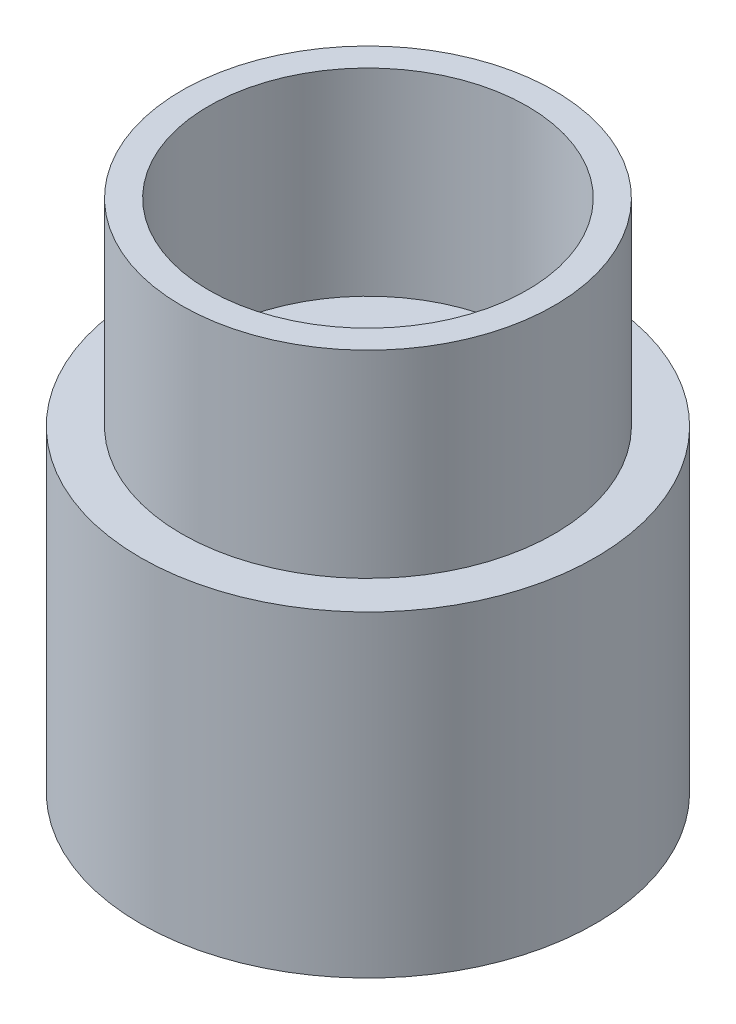
ISO-10303-21;
HEADER;
FILE_DESCRIPTION(('STEP AP214'),'2;1');
FILE_NAME('part.step','',(''),(''),'','','');
FILE_SCHEMA(('AUTOMOTIVE_DESIGN { 1 0 10303 214 1 1 1 1 }'));
ENDSEC;
DATA;
#1=APPLICATION_CONTEXT('core data for automotive mechanical design processes');
#2=APPLICATION_PROTOCOL_DEFINITION('international standard','automotive_design',2000,#1);
#3=PRODUCT_CONTEXT('',#1,'mechanical');
#4=PRODUCT('Part','Part','',(#3));
#5=PRODUCT_RELATED_PRODUCT_CATEGORY('part','',(#4));
#6=PRODUCT_DEFINITION_FORMATION('','',#4);
#7=PRODUCT_DEFINITION_CONTEXT('part definition',#1,'design');
#8=PRODUCT_DEFINITION('design','',#6,#7);
#9=PRODUCT_DEFINITION_SHAPE('','',#8);
#10=(LENGTH_UNIT() NAMED_UNIT(*) SI_UNIT(.MILLI.,.METRE.));
#11=(NAMED_UNIT(*) PLANE_ANGLE_UNIT() SI_UNIT($,.RADIAN.));
#12=(NAMED_UNIT(*) SI_UNIT($,.STERADIAN.) SOLID_ANGLE_UNIT());
#13=UNCERTAINTY_MEASURE_WITH_UNIT(LENGTH_MEASURE(1.E-05),#10,'distance_accuracy_value','');
#14=(GEOMETRIC_REPRESENTATION_CONTEXT(3) GLOBAL_UNCERTAINTY_ASSIGNED_CONTEXT((#13)) GLOBAL_UNIT_ASSIGNED_CONTEXT((#10,
#11,#12)) REPRESENTATION_CONTEXT('',''));
#15=CARTESIAN_POINT('',(0.,0.,0.));
#16=DIRECTION('',(0.,0.,1.));
#17=DIRECTION('',(1.,0.,0.));
#18=AXIS2_PLACEMENT_3D('',#15,#16,#17);
#19=CARTESIAN_POINT('',(0.,6.,0.));
#20=DIRECTION('',(0.,1.,0.));
#21=DIRECTION('',(0.,0.,1.));
#22=AXIS2_PLACEMENT_3D('',#19,#20,#21);
#23=PLANE('',#22);
#24=CARTESIAN_POINT('',(0.,6.,0.));
#25=DIRECTION('',(0.,1.,0.));
#26=DIRECTION('',(0.,0.,1.));
#27=AXIS2_PLACEMENT_3D('',#24,#25,#26);
#28=CIRCLE('',#27,11.05);
#29=CARTESIAN_POINT('',(0.,6.,11.05));
#30=VERTEX_POINT('',#29);
#31=EDGE_CURVE('E43',#30,#30,#28,.T.);
#32=ORIENTED_EDGE('',*,*,#31,.T.);
#33=EDGE_LOOP('',(#32));
#34=FACE_BOUND('',#33,.T.);
#35=CARTESIAN_POINT('',(0.,6.,0.));
#36=DIRECTION('',(0.,1.,0.));
#37=DIRECTION('',(0.,0.,1.));
#38=AXIS2_PLACEMENT_3D('',#35,#36,#37);
#39=CIRCLE('',#38,9.05);
#40=CARTESIAN_POINT('',(0.,6.,9.05));
#41=VERTEX_POINT('',#40);
#42=EDGE_CURVE('E50',#41,#41,#39,.T.);
#43=ORIENTED_EDGE('',*,*,#42,.F.);
#44=EDGE_LOOP('',(#43));
#45=FACE_BOUND('',#44,.T.);
#46=ADVANCED_FACE('F32',(#34,#45),#23,.T.);
#47=CARTESIAN_POINT('',(0.,-9.4,0.));
#48=DIRECTION('',(0.,1.,0.));
#49=DIRECTION('',(0.,0.,1.));
#50=AXIS2_PLACEMENT_3D('',#47,#48,#49);
#51=CYLINDRICAL_SURFACE('',#50,11.05);
#52=CARTESIAN_POINT('',(0.,-9.4,0.));
#53=DIRECTION('',(0.,1.,0.));
#54=DIRECTION('',(0.,0.,1.));
#55=AXIS2_PLACEMENT_3D('',#52,#53,#54);
#56=CIRCLE('',#55,11.05);
#57=CARTESIAN_POINT('',(0.,-9.4,11.05));
#58=VERTEX_POINT('',#57);
#59=EDGE_CURVE('E39',#58,#58,#56,.T.);
#60=ORIENTED_EDGE('',*,*,#59,.T.);
#61=EDGE_LOOP('',(#60));
#62=FACE_BOUND('',#61,.T.);
#63=ORIENTED_EDGE('',*,*,#31,.F.);
#64=EDGE_LOOP('',(#63));
#65=FACE_BOUND('',#64,.T.);
#66=ADVANCED_FACE('F34',(#62,#65),#51,.T.);
#67=CARTESIAN_POINT('',(0.,-9.4,0.));
#68=DIRECTION('',(0.,1.,0.));
#69=DIRECTION('',(0.,0.,1.));
#70=AXIS2_PLACEMENT_3D('',#67,#68,#69);
#71=PLANE('',#70);
#72=CARTESIAN_POINT('',(0.,-9.4,0.));
#73=DIRECTION('',(0.,-1.,0.));
#74=DIRECTION('',(0.,0.,-1.));
#75=AXIS2_PLACEMENT_3D('',#72,#73,#74);
#76=CIRCLE('',#75,9.15);
#77=CARTESIAN_POINT('',(0.,-9.4,-9.15));
#78=VERTEX_POINT('',#77);
#79=EDGE_CURVE('E58',#78,#78,#76,.T.);
#80=ORIENTED_EDGE('',*,*,#79,.F.);
#81=EDGE_LOOP('',(#80));
#82=FACE_BOUND('',#81,.T.);
#83=ORIENTED_EDGE('',*,*,#59,.F.);
#84=EDGE_LOOP('',(#83));
#85=FACE_BOUND('',#84,.T.);
#86=ADVANCED_FACE('F116',(#82,#85),#71,.F.);
#87=CARTESIAN_POINT('',(0.,15.6,0.));
#88=DIRECTION('',(0.,1.,0.));
#89=DIRECTION('',(0.,0.,1.));
#90=AXIS2_PLACEMENT_3D('',#87,#88,#89);
#91=PLANE('',#90);
#92=CARTESIAN_POINT('',(0.,15.6,0.));
#93=DIRECTION('',(0.,1.,0.));
#94=DIRECTION('',(0.,0.,1.));
#95=AXIS2_PLACEMENT_3D('',#92,#93,#94);
#96=CIRCLE('',#95,9.05);
#97=CARTESIAN_POINT('',(0.,15.6,9.05));
#98=VERTEX_POINT('',#97);
#99=EDGE_CURVE('E47',#98,#98,#96,.T.);
#100=ORIENTED_EDGE('',*,*,#99,.T.);
#101=EDGE_LOOP('',(#100));
#102=FACE_BOUND('',#101,.T.);
#103=CARTESIAN_POINT('',(0.,15.6,0.));
#104=DIRECTION('',(0.,1.,0.));
#105=DIRECTION('',(0.,0.,1.));
#106=AXIS2_PLACEMENT_3D('',#103,#104,#105);
#107=CIRCLE('',#106,7.74);
#108=CARTESIAN_POINT('',(0.,15.6,7.74));
#109=VERTEX_POINT('',#108);
#110=EDGE_CURVE('E53',#109,#109,#107,.T.);
#111=ORIENTED_EDGE('',*,*,#110,.F.);
#112=EDGE_LOOP('',(#111));
#113=FACE_BOUND('',#112,.T.);
#114=ADVANCED_FACE('F122',(#102,#113),#91,.T.);
#115=CARTESIAN_POINT('',(0.,15.6,0.));
#116=DIRECTION('',(0.,-1.,0.));
#117=DIRECTION('',(0.,0.,-1.));
#118=AXIS2_PLACEMENT_3D('',#115,#116,#117);
#119=CYLINDRICAL_SURFACE('',#118,9.05);
#120=ORIENTED_EDGE('',*,*,#99,.F.);
#121=EDGE_LOOP('',(#120));
#122=FACE_BOUND('',#121,.T.);
#123=ORIENTED_EDGE('',*,*,#42,.T.);
#124=EDGE_LOOP('',(#123));
#125=FACE_BOUND('',#124,.T.);
#126=ADVANCED_FACE('F107',(#122,#125),#119,.T.);
#127=CARTESIAN_POINT('',(0.,15.6,0.));
#128=DIRECTION('',(0.,-1.,0.));
#129=DIRECTION('',(0.,0.,-1.));
#130=AXIS2_PLACEMENT_3D('',#127,#128,#129);
#131=CYLINDRICAL_SURFACE('',#130,7.74);
#132=ORIENTED_EDGE('',*,*,#110,.T.);
#133=EDGE_LOOP('',(#132));
#134=FACE_BOUND('',#133,.T.);
#135=CARTESIAN_POINT('',(0.,6.,0.));
#136=DIRECTION('',(0.,1.,0.));
#137=DIRECTION('',(0.,0.,1.));
#138=AXIS2_PLACEMENT_3D('',#135,#136,#137);
#139=CIRCLE('',#138,7.74);
#140=CARTESIAN_POINT('',(0.,6.,7.74));
#141=VERTEX_POINT('',#140);
#142=EDGE_CURVE('E10',#141,#141,#139,.F.);
#143=ORIENTED_EDGE('',*,*,#142,.T.);
#144=EDGE_LOOP('',(#143));
#145=FACE_BOUND('',#144,.T.);
#146=ADVANCED_FACE('F97',(#134,#145),#131,.F.);
#147=CARTESIAN_POINT('',(0.,6.,0.));
#148=DIRECTION('',(0.,1.,0.));
#149=DIRECTION('',(0.,0.,1.));
#150=AXIS2_PLACEMENT_3D('',#147,#148,#149);
#151=CIRCLE('',#150,3.05);
#152=CARTESIAN_POINT('',(0.,6.,3.05));
#153=VERTEX_POINT('',#152);
#154=EDGE_CURVE('E61',#153,#153,#151,.T.);
#155=ORIENTED_EDGE('',*,*,#154,.F.);
#156=EDGE_LOOP('',(#155));
#157=FACE_BOUND('',#156,.T.);
#158=ORIENTED_EDGE('',*,*,#142,.F.);
#159=EDGE_LOOP('',(#158));
#160=FACE_BOUND('',#159,.T.);
#161=ADVANCED_FACE('F94',(#157,#160),#23,.T.);
#162=CARTESIAN_POINT('',(0.,25.8801081914276,0.));
#163=DIRECTION('',(0.,-1.,0.));
#164=DIRECTION('',(0.,0.,-1.));
#165=AXIS2_PLACEMENT_3D('',#162,#163,#164);
#166=CYLINDRICAL_SURFACE('',#165,9.15);
#167=ORIENTED_EDGE('',*,*,#79,.T.);
#168=EDGE_LOOP('',(#167));
#169=FACE_BOUND('',#168,.T.);
#170=CARTESIAN_POINT('',(0.,0.,0.));
#171=DIRECTION('',(0.,1.,0.));
#172=DIRECTION('',(0.,0.,1.));
#173=AXIS2_PLACEMENT_3D('',#170,#171,#172);
#174=CIRCLE('',#173,9.15);
#175=CARTESIAN_POINT('',(0.,0.,9.15));
#176=VERTEX_POINT('',#175);
#177=EDGE_CURVE('E70',#176,#176,#174,.T.);
#178=ORIENTED_EDGE('',*,*,#177,.T.);
#179=EDGE_LOOP('',(#178));
#180=FACE_BOUND('',#179,.T.);
#181=ADVANCED_FACE('F74',(#169,#180),#166,.F.);
#182=CARTESIAN_POINT('',(0.,6.,0.));
#183=DIRECTION('',(0.,-1.,0.));
#184=DIRECTION('',(0.,0.,-1.));
#185=AXIS2_PLACEMENT_3D('',#182,#183,#184);
#186=CONICAL_SURFACE('',#185,3.05,0.441240413270952);
#187=CARTESIAN_POINT('',(0.,1.5065884987597,0.));
#188=DIRECTION('',(0.,1.,0.));
#189=DIRECTION('',(0.,0.,1.));
#190=AXIS2_PLACEMENT_3D('',#187,#188,#189);
#191=CIRCLE('',#190,5.17222362541223);
#192=CARTESIAN_POINT('',(0.,1.5065884987597,5.17222362541223));
#193=VERTEX_POINT('',#192);
#194=EDGE_CURVE('E64',#193,#193,#191,.T.);
#195=ORIENTED_EDGE('',*,*,#194,.F.);
#196=EDGE_LOOP('',(#195));
#197=FACE_BOUND('',#196,.T.);
#198=ORIENTED_EDGE('',*,*,#154,.T.);
#199=EDGE_LOOP('',(#198));
#200=FACE_BOUND('',#199,.T.);
#201=ADVANCED_FACE('F85',(#197,#200),#186,.F.);
#202=CARTESIAN_POINT('',(-7.64341150124031,1.5065884987597,0.));
#203=DIRECTION('',(0.,1.,0.));
#204=DIRECTION('',(0.,0.,1.));
#205=AXIS2_PLACEMENT_3D('',#202,#203,#204);
#206=PLANE('',#205);
#207=CARTESIAN_POINT('',(0.,1.5065884987597,0.));
#208=DIRECTION('',(0.,1.,0.));
#209=DIRECTION('',(0.,0.,1.));
#210=AXIS2_PLACEMENT_3D('',#207,#208,#209);
#211=CIRCLE('',#210,7.64341150124031);
#212=CARTESIAN_POINT('',(0.,1.5065884987597,7.64341150124031));
#213=VERTEX_POINT('',#212);
#214=EDGE_CURVE('E67',#213,#213,#211,.T.);
#215=ORIENTED_EDGE('',*,*,#214,.F.);
#216=EDGE_LOOP('',(#215));
#217=FACE_BOUND('',#216,.T.);
#218=ORIENTED_EDGE('',*,*,#194,.T.);
#219=EDGE_LOOP('',(#218));
#220=FACE_BOUND('',#219,.T.);
#221=ADVANCED_FACE('F79',(#217,#220),#206,.F.);
#222=CARTESIAN_POINT('',(0.,1.5065884987597,0.));
#223=DIRECTION('',(0.,-1.,0.));
#224=DIRECTION('',(0.,0.,-1.));
#225=AXIS2_PLACEMENT_3D('',#222,#223,#224);
#226=CONICAL_SURFACE('',#225,7.64341150124031,0.785398163397447);
#227=ORIENTED_EDGE('',*,*,#177,.F.);
#228=EDGE_LOOP('',(#227));
#229=FACE_BOUND('',#228,.T.);
#230=ORIENTED_EDGE('',*,*,#214,.T.);
#231=EDGE_LOOP('',(#230));
#232=FACE_BOUND('',#231,.T.);
#233=ADVANCED_FACE('F76',(#229,#232),#226,.F.);
#234=CLOSED_SHELL('',(#46,#66,#86,#114,#126,#146,#161,#181,#201,#221,#233));
#235=MANIFOLD_SOLID_BREP('B2',#234);
#236=ADVANCED_BREP_SHAPE_REPRESENTATION('',(#18,#235),#14);
#237=SHAPE_DEFINITION_REPRESENTATION(#9,#236);
ENDSEC;
END-ISO-10303-21;
